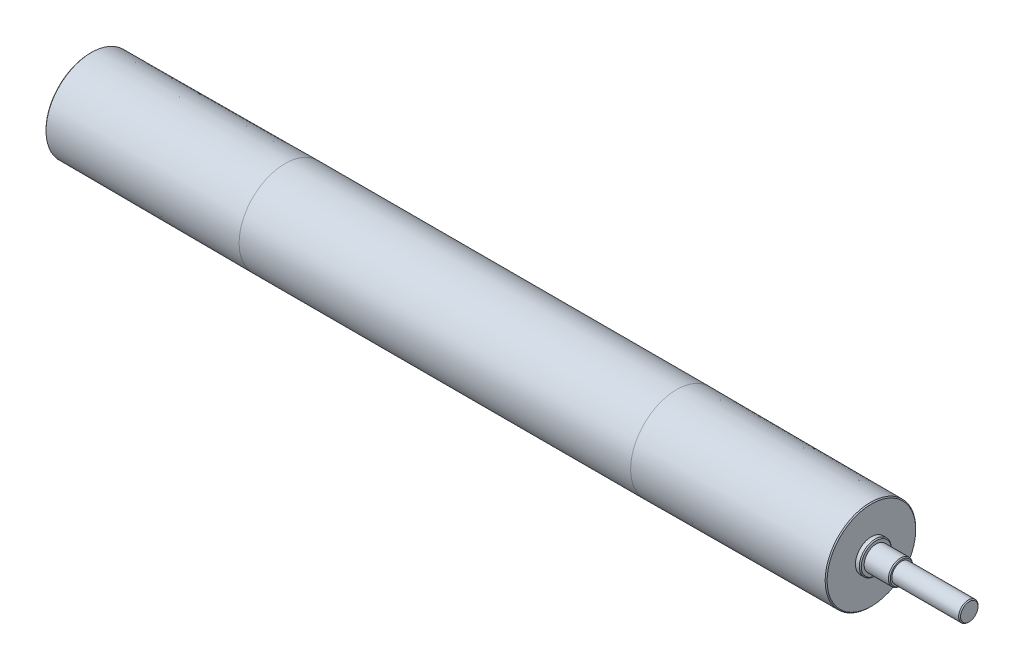
ISO-10303-21;
HEADER;
FILE_DESCRIPTION(('STEP AP214'),'2;1');
FILE_NAME('part.step','',(''),(''),'','','');
FILE_SCHEMA(('AUTOMOTIVE_DESIGN { 1 0 10303 214 1 1 1 1 }'));
ENDSEC;
DATA;
#1=APPLICATION_CONTEXT('core data for automotive mechanical design processes');
#2=APPLICATION_PROTOCOL_DEFINITION('international standard','automotive_design',2000,#1);
#3=PRODUCT_CONTEXT('',#1,'mechanical');
#4=PRODUCT('Part','Part','',(#3));
#5=PRODUCT_RELATED_PRODUCT_CATEGORY('part','',(#4));
#6=PRODUCT_DEFINITION_FORMATION('','',#4);
#7=PRODUCT_DEFINITION_CONTEXT('part definition',#1,'design');
#8=PRODUCT_DEFINITION('design','',#6,#7);
#9=PRODUCT_DEFINITION_SHAPE('','',#8);
#10=(LENGTH_UNIT() NAMED_UNIT(*) SI_UNIT(.MILLI.,.METRE.));
#11=(NAMED_UNIT(*) PLANE_ANGLE_UNIT() SI_UNIT($,.RADIAN.));
#12=(NAMED_UNIT(*) SI_UNIT($,.STERADIAN.) SOLID_ANGLE_UNIT());
#13=UNCERTAINTY_MEASURE_WITH_UNIT(LENGTH_MEASURE(1.E-05),#10,'distance_accuracy_value','');
#14=(GEOMETRIC_REPRESENTATION_CONTEXT(3) GLOBAL_UNCERTAINTY_ASSIGNED_CONTEXT((#13)) GLOBAL_UNIT_ASSIGNED_CONTEXT((#10,
#11,#12)) REPRESENTATION_CONTEXT('',''));
#15=CARTESIAN_POINT('',(0.,0.,0.));
#16=DIRECTION('',(0.,0.,1.));
#17=DIRECTION('',(1.,0.,0.));
#18=AXIS2_PLACEMENT_3D('',#15,#16,#17);
#19=CARTESIAN_POINT('',(-401.999999982421,0.,0.));
#20=DIRECTION('',(1.,0.,0.));
#21=DIRECTION('',(0.,0.,-1.));
#22=AXIS2_PLACEMENT_3D('',#19,#20,#21);
#23=CONICAL_SURFACE('',#22,46.75,0.00374998242202332);
#24=CARTESIAN_POINT('',(-201.999999982421,0.,0.));
#25=DIRECTION('',(-1.,0.,0.));
#26=DIRECTION('',(0.,0.,1.));
#27=AXIS2_PLACEMENT_3D('',#24,#25,#26);
#28=CIRCLE('',#27,47.5);
#29=CARTESIAN_POINT('',(-201.999999982421,0.,47.5));
#30=VERTEX_POINT('',#29);
#31=EDGE_CURVE('E97',#30,#30,#28,.T.);
#32=ORIENTED_EDGE('',*,*,#31,.T.);
#33=EDGE_LOOP('',(#32));
#34=FACE_BOUND('',#33,.T.);
#35=CARTESIAN_POINT('',(-401.999999982421,0.,0.));
#36=DIRECTION('',(-1.,0.,0.));
#37=DIRECTION('',(0.,0.,1.));
#38=AXIS2_PLACEMENT_3D('',#35,#36,#37);
#39=CIRCLE('',#38,46.75);
#40=CARTESIAN_POINT('',(-401.999999982421,0.,46.75));
#41=VERTEX_POINT('',#40);
#42=EDGE_CURVE('E160',#41,#41,#39,.T.);
#43=ORIENTED_EDGE('',*,*,#42,.F.);
#44=EDGE_LOOP('',(#43));
#45=FACE_BOUND('',#44,.T.);
#46=ADVANCED_FACE('F31',(#34,#45),#23,.T.);
#47=CARTESIAN_POINT('',(-402.999999982421,0.,0.));
#48=DIRECTION('',(1.,0.,0.));
#49=DIRECTION('',(0.,0.,-1.));
#50=AXIS2_PLACEMENT_3D('',#47,#48,#49);
#51=CONICAL_SURFACE('',#50,45.75,0.785398163397448);
#52=ORIENTED_EDGE('',*,*,#42,.T.);
#53=EDGE_LOOP('',(#52));
#54=FACE_BOUND('',#53,.T.);
#55=CARTESIAN_POINT('',(-402.999999982421,0.,0.));
#56=DIRECTION('',(-1.,0.,0.));
#57=DIRECTION('',(0.,0.,1.));
#58=AXIS2_PLACEMENT_3D('',#55,#56,#57);
#59=CIRCLE('',#58,45.75);
#60=CARTESIAN_POINT('',(-402.999999982421,0.,45.75));
#61=VERTEX_POINT('',#60);
#62=EDGE_CURVE('E157',#61,#61,#59,.T.);
#63=ORIENTED_EDGE('',*,*,#62,.F.);
#64=EDGE_LOOP('',(#63));
#65=FACE_BOUND('',#64,.T.);
#66=ADVANCED_FACE('F228',(#54,#65),#51,.T.);
#67=CARTESIAN_POINT('',(-402.999999982421,-45.75,0.));
#68=DIRECTION('',(-1.,0.,0.));
#69=DIRECTION('',(0.,0.,1.));
#70=AXIS2_PLACEMENT_3D('',#67,#68,#69);
#71=PLANE('',#70);
#72=ORIENTED_EDGE('',*,*,#62,.T.);
#73=EDGE_LOOP('',(#72));
#74=FACE_BOUND('',#73,.T.);
#75=CARTESIAN_POINT('',(-402.999999982421,0.,0.));
#76=DIRECTION('',(-1.,0.,0.));
#77=DIRECTION('',(0.,0.,1.));
#78=AXIS2_PLACEMENT_3D('',#75,#76,#77);
#79=CIRCLE('',#78,16.5);
#80=CARTESIAN_POINT('',(-402.999999982421,0.,16.5));
#81=VERTEX_POINT('',#80);
#82=EDGE_CURVE('E154',#81,#81,#79,.T.);
#83=ORIENTED_EDGE('',*,*,#82,.F.);
#84=EDGE_LOOP('',(#83));
#85=FACE_BOUND('',#84,.T.);
#86=ADVANCED_FACE('F233',(#74,#85),#71,.T.);
#87=CARTESIAN_POINT('',(-425.999999982421,0.,0.));
#88=DIRECTION('',(-1.,0.,0.));
#89=DIRECTION('',(0.,0.,1.));
#90=AXIS2_PLACEMENT_3D('',#87,#88,#89);
#91=CYLINDRICAL_SURFACE('',#90,16.5);
#92=ORIENTED_EDGE('',*,*,#82,.T.);
#93=EDGE_LOOP('',(#92));
#94=FACE_BOUND('',#93,.T.);
#95=CARTESIAN_POINT('',(-406.999999982421,0.,0.));
#96=DIRECTION('',(-1.,0.,0.));
#97=DIRECTION('',(0.,0.,1.));
#98=AXIS2_PLACEMENT_3D('',#95,#96,#97);
#99=CIRCLE('',#98,16.5);
#100=CARTESIAN_POINT('',(-406.999999982421,0.,16.5));
#101=VERTEX_POINT('',#100);
#102=EDGE_CURVE('E151',#101,#101,#99,.T.);
#103=ORIENTED_EDGE('',*,*,#102,.F.);
#104=EDGE_LOOP('',(#103));
#105=FACE_BOUND('',#104,.T.);
#106=ADVANCED_FACE('F243',(#94,#105),#91,.T.);
#107=CARTESIAN_POINT('',(-407.999999982421,0.,0.));
#108=DIRECTION('',(1.,0.,0.));
#109=DIRECTION('',(0.,0.,-1.));
#110=AXIS2_PLACEMENT_3D('',#107,#108,#109);
#111=CONICAL_SURFACE('',#110,15.5,0.78539816339745);
#112=ORIENTED_EDGE('',*,*,#102,.T.);
#113=EDGE_LOOP('',(#112));
#114=FACE_BOUND('',#113,.T.);
#115=CARTESIAN_POINT('',(-407.999999982421,0.,0.));
#116=DIRECTION('',(-1.,0.,0.));
#117=DIRECTION('',(0.,0.,1.));
#118=AXIS2_PLACEMENT_3D('',#115,#116,#117);
#119=CIRCLE('',#118,15.5);
#120=CARTESIAN_POINT('',(-407.999999982421,0.,15.5));
#121=VERTEX_POINT('',#120);
#122=EDGE_CURVE('E148',#121,#121,#119,.T.);
#123=ORIENTED_EDGE('',*,*,#122,.F.);
#124=EDGE_LOOP('',(#123));
#125=FACE_BOUND('',#124,.T.);
#126=ADVANCED_FACE('F249',(#114,#125),#111,.T.);
#127=CARTESIAN_POINT('',(-407.999999982421,-15.5,0.));
#128=DIRECTION('',(-1.,0.,0.));
#129=DIRECTION('',(0.,0.,1.));
#130=AXIS2_PLACEMENT_3D('',#127,#128,#129);
#131=PLANE('',#130);
#132=ORIENTED_EDGE('',*,*,#122,.T.);
#133=EDGE_LOOP('',(#132));
#134=FACE_BOUND('',#133,.T.);
#135=CARTESIAN_POINT('',(-407.999999982421,0.,0.));
#136=DIRECTION('',(-1.,0.,0.));
#137=DIRECTION('',(0.,0.,1.));
#138=AXIS2_PLACEMENT_3D('',#135,#136,#137);
#139=CIRCLE('',#138,12.5);
#140=CARTESIAN_POINT('',(-407.999999982421,0.,12.5));
#141=VERTEX_POINT('',#140);
#142=EDGE_CURVE('E145',#141,#141,#139,.T.);
#143=ORIENTED_EDGE('',*,*,#142,.F.);
#144=EDGE_LOOP('',(#143));
#145=FACE_BOUND('',#144,.T.);
#146=ADVANCED_FACE('F255',(#134,#145),#131,.T.);
#147=CARTESIAN_POINT('',(-425.999999982421,0.,0.));
#148=DIRECTION('',(-1.,0.,0.));
#149=DIRECTION('',(0.,0.,1.));
#150=AXIS2_PLACEMENT_3D('',#147,#148,#149);
#151=CYLINDRICAL_SURFACE('',#150,12.5);
#152=ORIENTED_EDGE('',*,*,#142,.T.);
#153=EDGE_LOOP('',(#152));
#154=FACE_BOUND('',#153,.T.);
#155=CARTESIAN_POINT('',(-424.999999982421,0.,0.));
#156=DIRECTION('',(-1.,0.,0.));
#157=DIRECTION('',(0.,0.,1.));
#158=AXIS2_PLACEMENT_3D('',#155,#156,#157);
#159=CIRCLE('',#158,12.5);
#160=CARTESIAN_POINT('',(-424.999999982421,0.,12.5));
#161=VERTEX_POINT('',#160);
#162=EDGE_CURVE('E142',#161,#161,#159,.T.);
#163=ORIENTED_EDGE('',*,*,#162,.F.);
#164=EDGE_LOOP('',(#163));
#165=FACE_BOUND('',#164,.T.);
#166=ADVANCED_FACE('F261',(#154,#165),#151,.T.);
#167=CARTESIAN_POINT('',(-425.999999982421,0.,0.));
#168=DIRECTION('',(1.,0.,0.));
#169=DIRECTION('',(0.,0.,-1.));
#170=AXIS2_PLACEMENT_3D('',#167,#168,#169);
#171=CONICAL_SURFACE('',#170,11.5,0.78539816339745);
#172=ORIENTED_EDGE('',*,*,#162,.T.);
#173=EDGE_LOOP('',(#172));
#174=FACE_BOUND('',#173,.T.);
#175=CARTESIAN_POINT('',(-425.999999982421,0.,0.));
#176=DIRECTION('',(-1.,0.,0.));
#177=DIRECTION('',(0.,0.,1.));
#178=AXIS2_PLACEMENT_3D('',#175,#176,#177);
#179=CIRCLE('',#178,11.5);
#180=CARTESIAN_POINT('',(-425.999999982421,0.,11.5));
#181=VERTEX_POINT('',#180);
#182=EDGE_CURVE('E139',#181,#181,#179,.T.);
#183=ORIENTED_EDGE('',*,*,#182,.F.);
#184=EDGE_LOOP('',(#183));
#185=FACE_BOUND('',#184,.T.);
#186=ADVANCED_FACE('F267',(#174,#185),#171,.T.);
#187=CARTESIAN_POINT('',(-425.999999982421,-11.5,0.));
#188=DIRECTION('',(-1.,0.,0.));
#189=DIRECTION('',(0.,0.,1.));
#190=AXIS2_PLACEMENT_3D('',#187,#188,#189);
#191=PLANE('',#190);
#192=ORIENTED_EDGE('',*,*,#182,.T.);
#193=EDGE_LOOP('',(#192));
#194=FACE_BOUND('',#193,.T.);
#195=ADVANCED_FACE('F273',(#194),#191,.T.);
#196=CARTESIAN_POINT('',(503.999999982421,-8.99999999999999,0.));
#197=DIRECTION('',(1.,0.,0.));
#198=DIRECTION('',(0.,0.,-1.));
#199=AXIS2_PLACEMENT_3D('',#196,#197,#198);
#200=PLANE('',#199);
#201=CARTESIAN_POINT('',(503.999999982421,0.,0.));
#202=DIRECTION('',(-1.,0.,0.));
#203=DIRECTION('',(0.,0.,1.));
#204=AXIS2_PLACEMENT_3D('',#201,#202,#203);
#205=CIRCLE('',#204,8.99999999999999);
#206=CARTESIAN_POINT('',(503.999999982421,0.,8.99999999999999));
#207=VERTEX_POINT('',#206);
#208=EDGE_CURVE('E136',#207,#207,#205,.T.);
#209=ORIENTED_EDGE('',*,*,#208,.F.);
#210=EDGE_LOOP('',(#209));
#211=FACE_BOUND('',#210,.T.);
#212=ADVANCED_FACE('F278',(#211),#200,.T.);
#213=CARTESIAN_POINT('',(502.999999982421,0.,0.));
#214=DIRECTION('',(-1.,0.,0.));
#215=DIRECTION('',(0.,0.,1.));
#216=AXIS2_PLACEMENT_3D('',#213,#214,#215);
#217=CONICAL_SURFACE('',#216,10.,0.785398163397507);
#218=ORIENTED_EDGE('',*,*,#208,.T.);
#219=EDGE_LOOP('',(#218));
#220=FACE_BOUND('',#219,.T.);
#221=CARTESIAN_POINT('',(502.999999982421,0.,0.));
#222=DIRECTION('',(-1.,0.,0.));
#223=DIRECTION('',(0.,0.,1.));
#224=AXIS2_PLACEMENT_3D('',#221,#222,#223);
#225=CIRCLE('',#224,10.);
#226=CARTESIAN_POINT('',(502.999999982421,0.,10.));
#227=VERTEX_POINT('',#226);
#228=EDGE_CURVE('E133',#227,#227,#225,.T.);
#229=ORIENTED_EDGE('',*,*,#228,.F.);
#230=EDGE_LOOP('',(#229));
#231=FACE_BOUND('',#230,.T.);
#232=ADVANCED_FACE('F225',(#220,#231),#217,.T.);
#233=CARTESIAN_POINT('',(-425.999999982421,0.,0.));
#234=DIRECTION('',(-1.,0.,0.));
#235=DIRECTION('',(0.,0.,1.));
#236=AXIS2_PLACEMENT_3D('',#233,#234,#235);
#237=CYLINDRICAL_SURFACE('',#236,10.);
#238=CARTESIAN_POINT('',(495.999999982421,3.,-9.53939201416945));
#239=CARTESIAN_POINT('',(496.082335503244,3.00001027845728,-9.53938054248206));
#240=CARTESIAN_POINT('',(496.164664437484,2.99661062684472,-9.54045772064378));
#241=CARTESIAN_POINT('',(496.328693935187,2.98307142899347,-9.54470412105986));
#242=CARTESIAN_POINT('',(496.410394635745,2.97293339805419,-9.54787287296848));
#243=CARTESIAN_POINT('',(496.572384898094,2.94603140625046,-9.55620668351003));
#244=CARTESIAN_POINT('',(496.652677506464,2.92928426957738,-9.56136667250114));
#245=CARTESIAN_POINT('',(496.811475826555,2.88932853030396,-9.57351626651178));
#246=CARTESIAN_POINT('',(496.889981491489,2.86611975872642,-9.58050591937827));
#247=CARTESIAN_POINT('',(497.121949370411,2.78708584446026,-9.60391637654136));
#248=CARTESIAN_POINT('',(497.272068421254,2.72181852542974,-9.6227900783039));
#249=CARTESIAN_POINT('',(497.5592260264,2.56815043531278,-9.66493213967818));
#250=CARTESIAN_POINT('',(497.696258453183,2.47973889924162,-9.6882025429064));
#251=CARTESIAN_POINT('',(497.957722970369,2.27929879634445,-9.73733650515374));
#252=CARTESIAN_POINT('',(498.081684856482,2.16666914746587,-9.76325505469873));
#253=CARTESIAN_POINT('',(498.30927359726,1.92227736150436,-9.81429628475076));
#254=CARTESIAN_POINT('',(498.412897016282,1.79051199848167,-9.83941883019409));
#255=CARTESIAN_POINT('',(498.598926847516,1.508219974657,-9.88666477976534));
#256=CARTESIAN_POINT('',(498.680850162204,1.35736167401017,-9.90871541546877));
#257=CARTESIAN_POINT('',(498.817976986424,1.04324233568303,-9.94668940088144));
#258=CARTESIAN_POINT('',(498.873187385789,0.879984508687995,-9.96261433032402));
#259=CARTESIAN_POINT('',(498.953759534212,0.550649404820613,-9.98615279768397));
#260=CARTESIAN_POINT('',(498.979929685939,0.384786253016212,-9.99399098526792));
#261=CARTESIAN_POINT('',(499.004234677567,0.0508471415689337,-10.0012640407204));
#262=CARTESIAN_POINT('',(499.002374825099,-0.117228393125334,-10.0007004995012));
#263=CARTESIAN_POINT('',(498.97121416173,-0.44514319927182,-9.99139205125586));
#264=CARTESIAN_POINT('',(498.942789291613,-0.605074290763024,-9.98290831016512));
#265=CARTESIAN_POINT('',(498.860736712796,-0.917780104370305,-9.95903027401822));
#266=CARTESIAN_POINT('',(498.807107683738,-1.07055445110878,-9.94363561692558));
#267=CARTESIAN_POINT('',(498.675575538896,-1.36669563173911,-9.90730429851782));
#268=CARTESIAN_POINT('',(498.597396693645,-1.50993201207613,-9.88630511384915));
#269=CARTESIAN_POINT('',(498.419202802387,-1.78153105916101,-9.84099249303646));
#270=CARTESIAN_POINT('',(498.31918286348,-1.90989038323251,-9.81667831471806));
#271=CARTESIAN_POINT('',(498.095616006237,-2.15330901082204,-9.7662334714278));
#272=CARTESIAN_POINT('',(497.971312254895,-2.26766702955974,-9.74006890899097));
#273=CARTESIAN_POINT('',(497.70500513557,-2.47413538985066,-9.68968430229327));
#274=CARTESIAN_POINT('',(497.562996621691,-2.5662392402618,-9.66546482675133));
#275=CARTESIAN_POINT('',(497.263438125521,-2.72632814481702,-9.62154457591303));
#276=CARTESIAN_POINT('',(497.105745623234,-2.79406012682262,-9.60189192491895));
#277=CARTESIAN_POINT('',(496.780550974458,-2.90171772009403,-9.56991327306403));
#278=CARTESIAN_POINT('',(496.613064260992,-2.94168586436071,-9.5575760695175));
#279=CARTESIAN_POINT('',(496.370010204281,-2.97802407180158,-9.54628064650012));
#280=CARTESIAN_POINT('',(496.296218514062,-2.98626405978017,-9.54370312550533));
#281=CARTESIAN_POINT('',(496.148297024222,-2.99724711229708,-9.54025857223564));
#282=CARTESIAN_POINT('',(496.074167883093,-2.99999825936538,-9.53938902493288));
#283=CARTESIAN_POINT('',(495.999999982421,-3.,-9.53939201416945));
#284=B_SPLINE_CURVE_WITH_KNOTS('',3,(#238,#239,#240,#241,#242,#243,#244,#245,#246,#247,#248,
#249,#250,#251,#252,#253,#254,#255,#256,#257,#258,#259,#260,#261,#262,#263,#264,#265,#266,#267,
#268,#269,#270,#271,#272,#273,#274,#275,#276,#277,#278,#279,#280,#281,#282,#283),.UNSPECIFIED.,
.F.,.F.,(4,2,2,2,2,2,2,2,2,2,2,2,2,2,2,2,2,2,2,2,2,2,4),(0.,0.246918142439419,0.493780777706024,
0.740019009622899,0.986263681482011,1.47813347402017,1.97023245590772,2.47635119822762,
2.9825553623903,3.49922810620069,4.01576751791671,4.51753600864763,5.019209488041,
5.50490358251093,5.99062312360831,6.4820058335062,6.9734987373917,7.48389234847121,
7.99443465298712,8.51013494368211,9.02504345105571,9.24774267716771,9.4701137273239),.UNSPECIFIED.);
#285=CARTESIAN_POINT('',(495.999999982421,3.,-9.53939201416945));
#286=VERTEX_POINT('',#285);
#287=CARTESIAN_POINT('',(495.999999982421,-3.,-9.53939201416945));
#288=VERTEX_POINT('',#287);
#289=EDGE_CURVE('E163',#286,#288,#284,.T.);
#290=ORIENTED_EDGE('',*,*,#289,.F.);
#291=DIRECTION('',(-1.,0.,0.));
#292=VECTOR('',#291,1.);
#293=CARTESIAN_POINT('',(-425.999999982421,3.,-9.53939201416945));
#294=LINE('',#293,#292);
#295=CARTESIAN_POINT('',(451.999999982421,3.,-9.53939201416945));
#296=VERTEX_POINT('',#295);
#297=EDGE_CURVE('E11',#296,#286,#294,.F.);
#298=ORIENTED_EDGE('',*,*,#297,.F.);
#299=CARTESIAN_POINT('',(451.999999982421,-3.,-9.53939201416945));
#300=CARTESIAN_POINT('',(451.917664461599,-3.00001027845728,-9.53938054248206));
#301=CARTESIAN_POINT('',(451.835335527358,-2.99661062684473,-9.54045772064378));
#302=CARTESIAN_POINT('',(451.671306029656,-2.98307142899348,-9.54470412105985));
#303=CARTESIAN_POINT('',(451.589605329097,-2.9729333980542,-9.54787287296848));
#304=CARTESIAN_POINT('',(451.427615066748,-2.94603140625047,-9.55620668351002));
#305=CARTESIAN_POINT('',(451.347322458378,-2.92928426957739,-9.56136667250114));
#306=CARTESIAN_POINT('',(451.188524138287,-2.88932853030397,-9.57351626651177));
#307=CARTESIAN_POINT('',(451.110018473354,-2.86611975872643,-9.58050591937827));
#308=CARTESIAN_POINT('',(450.878050594431,-2.78708584446027,-9.60391637654136));
#309=CARTESIAN_POINT('',(450.727931543588,-2.72181852542975,-9.6227900783039));
#310=CARTESIAN_POINT('',(450.440773938442,-2.56815043531278,-9.66493213967818));
#311=CARTESIAN_POINT('',(450.303741511659,-2.47973889924163,-9.6882025429064));
#312=CARTESIAN_POINT('',(450.042276994473,-2.27929879634446,-9.73733650515373));
#313=CARTESIAN_POINT('',(449.91831510836,-2.16666914746589,-9.76325505469872));
#314=CARTESIAN_POINT('',(449.690726367582,-1.92227736150438,-9.81429628475076));
#315=CARTESIAN_POINT('',(449.58710294856,-1.79051199848168,-9.83941883019409));
#316=CARTESIAN_POINT('',(449.401073117327,-1.50821997465701,-9.88666477976534));
#317=CARTESIAN_POINT('',(449.319149802639,-1.3573616740102,-9.90871541546877));
#318=CARTESIAN_POINT('',(449.182022978418,-1.04324233568308,-9.94668940088143));
#319=CARTESIAN_POINT('',(449.126812579053,-0.879984508688037,-9.96261433032402));
#320=CARTESIAN_POINT('',(449.04624043063,-0.550649404820658,-9.98615279768397));
#321=CARTESIAN_POINT('',(449.020070278904,-0.384786253016264,-9.99399098526792));
#322=CARTESIAN_POINT('',(448.995765287275,-0.0508471415689935,-10.0012640407204));
#323=CARTESIAN_POINT('',(448.997625139743,0.117228393125273,-10.0007004995012));
#324=CARTESIAN_POINT('',(449.028785803113,0.445143199271763,-9.99139205125586));
#325=CARTESIAN_POINT('',(449.057210673229,0.605074290762971,-9.98290831016512));
#326=CARTESIAN_POINT('',(449.139263252047,0.917780104370259,-9.95903027401823));
#327=CARTESIAN_POINT('',(449.192892281104,1.07055445110873,-9.94363561692559));
#328=CARTESIAN_POINT('',(449.324424425946,1.36669563173906,-9.90730429851782));
#329=CARTESIAN_POINT('',(449.402603271197,1.50993201207607,-9.88630511384915));
#330=CARTESIAN_POINT('',(449.580797162456,1.78153105916094,-9.84099249303648));
#331=CARTESIAN_POINT('',(449.680817101362,1.90989038323244,-9.81667831471807));
#332=CARTESIAN_POINT('',(449.904383958606,2.15330901082201,-9.76623347142781));
#333=CARTESIAN_POINT('',(450.028687709947,2.26766702955972,-9.74006890899098));
#334=CARTESIAN_POINT('',(450.294994829272,2.47413538985064,-9.68968430229328));
#335=CARTESIAN_POINT('',(450.437003343151,2.56623924026177,-9.66546482675134));
#336=CARTESIAN_POINT('',(450.736561839321,2.72632814481699,-9.62154457591303));
#337=CARTESIAN_POINT('',(450.894254341608,2.79406012682261,-9.60189192491896));
#338=CARTESIAN_POINT('',(451.219448990384,2.90171772009404,-9.56991327306402));
#339=CARTESIAN_POINT('',(451.38693570385,2.94168586436071,-9.5575760695175));
#340=CARTESIAN_POINT('',(451.629989760562,2.97802407180158,-9.54628064650012));
#341=CARTESIAN_POINT('',(451.70378145078,2.98626405978017,-9.54370312550533));
#342=CARTESIAN_POINT('',(451.85170294062,2.99724711229709,-9.54025857223564));
#343=CARTESIAN_POINT('',(451.925832081749,2.99999825936538,-9.53938902493287));
#344=CARTESIAN_POINT('',(451.999999982421,3.,-9.53939201416945));
#345=B_SPLINE_CURVE_WITH_KNOTS('',3,(#299,#300,#301,#302,#303,#304,#305,#306,#307,#308,#309,
#310,#311,#312,#313,#314,#315,#316,#317,#318,#319,#320,#321,#322,#323,#324,#325,#326,#327,#328,
#329,#330,#331,#332,#333,#334,#335,#336,#337,#338,#339,#340,#341,#342,#343,#344),.UNSPECIFIED.,
.F.,.F.,(4,2,2,2,2,2,2,2,2,2,2,2,2,2,2,2,2,2,2,2,2,2,4),(0.,0.246918142439418,0.493780777706023,
0.740019009622954,0.986263681482008,1.47813347402023,1.97023245590777,2.47635119822762,
2.98255536239031,3.4992281062007,4.01576751791671,4.51753600864762,5.019209488041,
5.50490358251091,5.9906231236083,6.48200583350621,6.97349873739168,7.48389234847121,
7.99443465298716,8.51013494368217,9.02504345105577,9.24774267716782,9.47011372732401),.UNSPECIFIED.);
#346=CARTESIAN_POINT('',(451.999999982421,-3.,-9.53939201416945));
#347=VERTEX_POINT('',#346);
#348=EDGE_CURVE('E38',#347,#296,#345,.T.);
#349=ORIENTED_EDGE('',*,*,#348,.F.);
#350=DIRECTION('',(-1.,0.,0.));
#351=VECTOR('',#350,1.);
#352=CARTESIAN_POINT('',(-425.999999982421,-3.,-9.53939201416945));
#353=LINE('',#352,#351);
#354=EDGE_CURVE('E170',#347,#288,#353,.F.);
#355=ORIENTED_EDGE('',*,*,#354,.T.);
#356=EDGE_LOOP('',(#290,#298,#349,#355));
#357=FACE_BOUND('',#356,.T.);
#358=ORIENTED_EDGE('',*,*,#228,.T.);
#359=EDGE_LOOP('',(#358));
#360=FACE_BOUND('',#359,.T.);
#361=CARTESIAN_POINT('',(433.999999982421,0.,0.));
#362=DIRECTION('',(-1.,0.,0.));
#363=DIRECTION('',(0.,0.,1.));
#364=AXIS2_PLACEMENT_3D('',#361,#362,#363);
#365=CIRCLE('',#364,10.);
#366=CARTESIAN_POINT('',(433.999999982421,0.,10.));
#367=VERTEX_POINT('',#366);
#368=EDGE_CURVE('E130',#367,#367,#365,.T.);
#369=ORIENTED_EDGE('',*,*,#368,.F.);
#370=EDGE_LOOP('',(#369));
#371=FACE_BOUND('',#370,.T.);
#372=ADVANCED_FACE('F171',(#357,#360,#371),#237,.T.);
#373=CARTESIAN_POINT('',(433.999999982421,-11.5,0.));
#374=DIRECTION('',(1.,0.,0.));
#375=DIRECTION('',(0.,0.,-1.));
#376=AXIS2_PLACEMENT_3D('',#373,#374,#375);
#377=PLANE('',#376);
#378=ORIENTED_EDGE('',*,*,#368,.T.);
#379=EDGE_LOOP('',(#378));
#380=FACE_BOUND('',#379,.T.);
#381=CARTESIAN_POINT('',(433.999999982421,0.,0.));
#382=DIRECTION('',(-1.,0.,0.));
#383=DIRECTION('',(0.,0.,1.));
#384=AXIS2_PLACEMENT_3D('',#381,#382,#383);
#385=CIRCLE('',#384,11.5);
#386=CARTESIAN_POINT('',(433.999999982421,0.,11.5));
#387=VERTEX_POINT('',#386);
#388=EDGE_CURVE('E127',#387,#387,#385,.T.);
#389=ORIENTED_EDGE('',*,*,#388,.F.);
#390=EDGE_LOOP('',(#389));
#391=FACE_BOUND('',#390,.T.);
#392=ADVANCED_FACE('F218',(#380,#391),#377,.T.);
#393=CARTESIAN_POINT('',(432.999999982421,0.,0.));
#394=DIRECTION('',(-1.,0.,0.));
#395=DIRECTION('',(0.,0.,1.));
#396=AXIS2_PLACEMENT_3D('',#393,#394,#395);
#397=CONICAL_SURFACE('',#396,12.5,0.78539816339745);
#398=ORIENTED_EDGE('',*,*,#388,.T.);
#399=EDGE_LOOP('',(#398));
#400=FACE_BOUND('',#399,.T.);
#401=CARTESIAN_POINT('',(432.999999982421,0.,0.));
#402=DIRECTION('',(-1.,0.,0.));
#403=DIRECTION('',(0.,0.,1.));
#404=AXIS2_PLACEMENT_3D('',#401,#402,#403);
#405=CIRCLE('',#404,12.5);
#406=CARTESIAN_POINT('',(432.999999982421,0.,12.5));
#407=VERTEX_POINT('',#406);
#408=EDGE_CURVE('E124',#407,#407,#405,.T.);
#409=ORIENTED_EDGE('',*,*,#408,.F.);
#410=EDGE_LOOP('',(#409));
#411=FACE_BOUND('',#410,.T.);
#412=ADVANCED_FACE('F215',(#400,#411),#397,.T.);
#413=CARTESIAN_POINT('',(-425.999999982421,0.,0.));
#414=DIRECTION('',(-1.,0.,0.));
#415=DIRECTION('',(0.,0.,1.));
#416=AXIS2_PLACEMENT_3D('',#413,#414,#415);
#417=CYLINDRICAL_SURFACE('',#416,12.5);
#418=ORIENTED_EDGE('',*,*,#408,.T.);
#419=EDGE_LOOP('',(#418));
#420=FACE_BOUND('',#419,.T.);
#421=CARTESIAN_POINT('',(407.999999982421,0.,0.));
#422=DIRECTION('',(-1.,0.,0.));
#423=DIRECTION('',(0.,0.,1.));
#424=AXIS2_PLACEMENT_3D('',#421,#422,#423);
#425=CIRCLE('',#424,12.5);
#426=CARTESIAN_POINT('',(407.999999982421,0.,12.5));
#427=VERTEX_POINT('',#426);
#428=EDGE_CURVE('E121',#427,#427,#425,.T.);
#429=ORIENTED_EDGE('',*,*,#428,.F.);
#430=EDGE_LOOP('',(#429));
#431=FACE_BOUND('',#430,.T.);
#432=ADVANCED_FACE('F211',(#420,#431),#417,.T.);
#433=CARTESIAN_POINT('',(407.999999982421,-15.5,0.));
#434=DIRECTION('',(1.,0.,0.));
#435=DIRECTION('',(0.,0.,-1.));
#436=AXIS2_PLACEMENT_3D('',#433,#434,#435);
#437=PLANE('',#436);
#438=ORIENTED_EDGE('',*,*,#428,.T.);
#439=EDGE_LOOP('',(#438));
#440=FACE_BOUND('',#439,.T.);
#441=CARTESIAN_POINT('',(407.999999982421,0.,0.));
#442=DIRECTION('',(-1.,0.,0.));
#443=DIRECTION('',(0.,0.,1.));
#444=AXIS2_PLACEMENT_3D('',#441,#442,#443);
#445=CIRCLE('',#444,15.5);
#446=CARTESIAN_POINT('',(407.999999982421,0.,15.5));
#447=VERTEX_POINT('',#446);
#448=EDGE_CURVE('E118',#447,#447,#445,.T.);
#449=ORIENTED_EDGE('',*,*,#448,.F.);
#450=EDGE_LOOP('',(#449));
#451=FACE_BOUND('',#450,.T.);
#452=ADVANCED_FACE('F207',(#440,#451),#437,.T.);
#453=CARTESIAN_POINT('',(406.999999982421,0.,0.));
#454=DIRECTION('',(-1.,0.,0.));
#455=DIRECTION('',(0.,0.,1.));
#456=AXIS2_PLACEMENT_3D('',#453,#454,#455);
#457=CONICAL_SURFACE('',#456,16.5,0.78539816339745);
#458=ORIENTED_EDGE('',*,*,#448,.T.);
#459=EDGE_LOOP('',(#458));
#460=FACE_BOUND('',#459,.T.);
#461=CARTESIAN_POINT('',(406.999999982421,0.,0.));
#462=DIRECTION('',(-1.,0.,0.));
#463=DIRECTION('',(0.,0.,1.));
#464=AXIS2_PLACEMENT_3D('',#461,#462,#463);
#465=CIRCLE('',#464,16.5);
#466=CARTESIAN_POINT('',(406.999999982421,0.,16.5));
#467=VERTEX_POINT('',#466);
#468=EDGE_CURVE('E115',#467,#467,#465,.T.);
#469=ORIENTED_EDGE('',*,*,#468,.F.);
#470=EDGE_LOOP('',(#469));
#471=FACE_BOUND('',#470,.T.);
#472=ADVANCED_FACE('F203',(#460,#471),#457,.T.);
#473=CARTESIAN_POINT('',(-425.999999982421,0.,0.));
#474=DIRECTION('',(-1.,0.,0.));
#475=DIRECTION('',(0.,0.,1.));
#476=AXIS2_PLACEMENT_3D('',#473,#474,#475);
#477=CYLINDRICAL_SURFACE('',#476,16.5);
#478=ORIENTED_EDGE('',*,*,#468,.T.);
#479=EDGE_LOOP('',(#478));
#480=FACE_BOUND('',#479,.T.);
#481=CARTESIAN_POINT('',(402.999999982421,0.,0.));
#482=DIRECTION('',(-1.,0.,0.));
#483=DIRECTION('',(0.,0.,1.));
#484=AXIS2_PLACEMENT_3D('',#481,#482,#483);
#485=CIRCLE('',#484,16.5);
#486=CARTESIAN_POINT('',(402.999999982421,0.,16.5));
#487=VERTEX_POINT('',#486);
#488=EDGE_CURVE('E112',#487,#487,#485,.T.);
#489=ORIENTED_EDGE('',*,*,#488,.F.);
#490=EDGE_LOOP('',(#489));
#491=FACE_BOUND('',#490,.T.);
#492=ADVANCED_FACE('F199',(#480,#491),#477,.T.);
#493=CARTESIAN_POINT('',(402.999999982421,-45.7424717691342,0.));
#494=DIRECTION('',(1.,0.,0.));
#495=DIRECTION('',(0.,0.,-1.));
#496=AXIS2_PLACEMENT_3D('',#493,#494,#495);
#497=PLANE('',#496);
#498=ORIENTED_EDGE('',*,*,#488,.T.);
#499=EDGE_LOOP('',(#498));
#500=FACE_BOUND('',#499,.T.);
#501=CARTESIAN_POINT('',(402.999999982421,0.,0.));
#502=DIRECTION('',(-1.,0.,0.));
#503=DIRECTION('',(0.,0.,1.));
#504=AXIS2_PLACEMENT_3D('',#501,#502,#503);
#505=CIRCLE('',#504,45.7424717691342);
#506=CARTESIAN_POINT('',(402.999999982421,0.,45.7424717691342));
#507=VERTEX_POINT('',#506);
#508=EDGE_CURVE('E109',#507,#507,#505,.T.);
#509=ORIENTED_EDGE('',*,*,#508,.F.);
#510=EDGE_LOOP('',(#509));
#511=FACE_BOUND('',#510,.T.);
#512=ADVANCED_FACE('F195',(#500,#511),#497,.T.);
#513=CARTESIAN_POINT('',(401.999999982421,0.,0.));
#514=DIRECTION('',(-1.,0.,0.));
#515=DIRECTION('',(0.,0.,1.));
#516=AXIS2_PLACEMENT_3D('',#513,#514,#515);
#517=CONICAL_SURFACE('',#516,46.75,0.789148145819473);
#518=ORIENTED_EDGE('',*,*,#508,.T.);
#519=EDGE_LOOP('',(#518));
#520=FACE_BOUND('',#519,.T.);
#521=CARTESIAN_POINT('',(401.999999982421,0.,0.));
#522=DIRECTION('',(-1.,0.,0.));
#523=DIRECTION('',(0.,0.,1.));
#524=AXIS2_PLACEMENT_3D('',#521,#522,#523);
#525=CIRCLE('',#524,46.75);
#526=CARTESIAN_POINT('',(401.999999982421,0.,46.75));
#527=VERTEX_POINT('',#526);
#528=EDGE_CURVE('E106',#527,#527,#525,.T.);
#529=ORIENTED_EDGE('',*,*,#528,.F.);
#530=EDGE_LOOP('',(#529));
#531=FACE_BOUND('',#530,.T.);
#532=ADVANCED_FACE('F191',(#520,#531),#517,.T.);
#533=CARTESIAN_POINT('',(201.999999982421,0.,0.));
#534=DIRECTION('',(-1.,0.,0.));
#535=DIRECTION('',(0.,0.,1.));
#536=AXIS2_PLACEMENT_3D('',#533,#534,#535);
#537=CONICAL_SURFACE('',#536,47.5,0.00374998242202332);
#538=ORIENTED_EDGE('',*,*,#528,.T.);
#539=EDGE_LOOP('',(#538));
#540=FACE_BOUND('',#539,.T.);
#541=CARTESIAN_POINT('',(201.999999982421,0.,0.));
#542=DIRECTION('',(-1.,0.,0.));
#543=DIRECTION('',(0.,0.,1.));
#544=AXIS2_PLACEMENT_3D('',#541,#542,#543);
#545=CIRCLE('',#544,47.5);
#546=CARTESIAN_POINT('',(201.999999982421,0.,47.5));
#547=VERTEX_POINT('',#546);
#548=EDGE_CURVE('E103',#547,#547,#545,.T.);
#549=ORIENTED_EDGE('',*,*,#548,.F.);
#550=EDGE_LOOP('',(#549));
#551=FACE_BOUND('',#550,.T.);
#552=ADVANCED_FACE('F187',(#540,#551),#537,.T.);
#553=CARTESIAN_POINT('',(-425.999999982421,0.,0.));
#554=DIRECTION('',(-1.,0.,0.));
#555=DIRECTION('',(0.,0.,1.));
#556=AXIS2_PLACEMENT_3D('',#553,#554,#555);
#557=CYLINDRICAL_SURFACE('',#556,47.5);
#558=ORIENTED_EDGE('',*,*,#548,.T.);
#559=EDGE_LOOP('',(#558));
#560=FACE_BOUND('',#559,.T.);
#561=ORIENTED_EDGE('',*,*,#31,.F.);
#562=EDGE_LOOP('',(#561));
#563=FACE_BOUND('',#562,.T.);
#564=ADVANCED_FACE('F184',(#560,#563),#557,.T.);
#565=CARTESIAN_POINT('',(431.068177868879,3.,-6.5));
#566=DIRECTION('',(0.,1.,0.));
#567=DIRECTION('',(0.,0.,1.));
#568=AXIS2_PLACEMENT_3D('',#565,#566,#567);
#569=PLANE('',#568);
#570=ORIENTED_EDGE('',*,*,#297,.T.);
#571=DIRECTION('',(0.,0.,-1.));
#572=VECTOR('',#571,1.);
#573=CARTESIAN_POINT('',(495.999999982421,3.,-6.5));
#574=LINE('',#573,#572);
#575=CARTESIAN_POINT('',(495.999999982421,3.,-6.5));
#576=VERTEX_POINT('',#575);
#577=EDGE_CURVE('E70',#576,#286,#574,.T.);
#578=ORIENTED_EDGE('',*,*,#577,.F.);
#579=DIRECTION('',(1.,0.,0.));
#580=VECTOR('',#579,1.);
#581=CARTESIAN_POINT('',(431.068177868879,3.,-6.5));
#582=LINE('',#581,#580);
#583=CARTESIAN_POINT('',(451.999999982421,3.,-6.5));
#584=VERTEX_POINT('',#583);
#585=EDGE_CURVE('E74',#584,#576,#582,.T.);
#586=ORIENTED_EDGE('',*,*,#585,.F.);
#587=DIRECTION('',(0.,0.,-1.));
#588=VECTOR('',#587,1.);
#589=CARTESIAN_POINT('',(451.999999982421,3.,-6.5));
#590=LINE('',#589,#588);
#591=EDGE_CURVE('E95',#584,#296,#590,.T.);
#592=ORIENTED_EDGE('',*,*,#591,.T.);
#593=EDGE_LOOP('',(#570,#578,#586,#592));
#594=FACE_BOUND('',#593,.T.);
#595=ADVANCED_FACE('F72',(#594),#569,.F.);
#596=CARTESIAN_POINT('',(451.999999982421,0.,-6.5));
#597=DIRECTION('',(0.,0.,-1.));
#598=DIRECTION('',(0.,1.,0.));
#599=AXIS2_PLACEMENT_3D('',#596,#597,#598);
#600=CYLINDRICAL_SURFACE('',#599,3.);
#601=DIRECTION('',(0.,0.,-1.));
#602=VECTOR('',#601,1.);
#603=CARTESIAN_POINT('',(451.999999982421,-3.,-6.5));
#604=LINE('',#603,#602);
#605=CARTESIAN_POINT('',(451.999999982421,-3.,-6.5));
#606=VERTEX_POINT('',#605);
#607=EDGE_CURVE('E98',#606,#347,#604,.T.);
#608=ORIENTED_EDGE('',*,*,#607,.T.);
#609=ORIENTED_EDGE('',*,*,#348,.T.);
#610=ORIENTED_EDGE('',*,*,#591,.F.);
#611=CARTESIAN_POINT('',(451.999999982421,0.,-6.5));
#612=DIRECTION('',(0.,0.,-1.));
#613=DIRECTION('',(0.,1.,0.));
#614=AXIS2_PLACEMENT_3D('',#611,#612,#613);
#615=CIRCLE('',#614,3.);
#616=EDGE_CURVE('E78',#606,#584,#615,.T.);
#617=ORIENTED_EDGE('',*,*,#616,.F.);
#618=EDGE_LOOP('',(#608,#609,#610,#617));
#619=FACE_BOUND('',#618,.T.);
#620=ADVANCED_FACE('F183',(#619),#600,.F.);
#621=CARTESIAN_POINT('',(431.068177868879,-3.,-6.5));
#622=DIRECTION('',(0.,1.,0.));
#623=DIRECTION('',(0.,0.,1.));
#624=AXIS2_PLACEMENT_3D('',#621,#622,#623);
#625=PLANE('',#624);
#626=ORIENTED_EDGE('',*,*,#607,.F.);
#627=DIRECTION('',(1.,0.,0.));
#628=VECTOR('',#627,1.);
#629=CARTESIAN_POINT('',(431.068177868879,-3.,-6.5));
#630=LINE('',#629,#628);
#631=CARTESIAN_POINT('',(495.999999982421,-3.,-6.5));
#632=VERTEX_POINT('',#631);
#633=EDGE_CURVE('E87',#606,#632,#630,.T.);
#634=ORIENTED_EDGE('',*,*,#633,.T.);
#635=DIRECTION('',(0.,0.,-1.));
#636=VECTOR('',#635,1.);
#637=CARTESIAN_POINT('',(495.999999982421,-3.,-6.5));
#638=LINE('',#637,#636);
#639=EDGE_CURVE('E77',#632,#288,#638,.T.);
#640=ORIENTED_EDGE('',*,*,#639,.T.);
#641=ORIENTED_EDGE('',*,*,#354,.F.);
#642=EDGE_LOOP('',(#626,#634,#640,#641));
#643=FACE_BOUND('',#642,.T.);
#644=ADVANCED_FACE('F179',(#643),#625,.T.);
#645=CARTESIAN_POINT('',(495.999999982421,0.,-6.5));
#646=DIRECTION('',(0.,0.,-1.));
#647=DIRECTION('',(0.,1.,0.));
#648=AXIS2_PLACEMENT_3D('',#645,#646,#647);
#649=CYLINDRICAL_SURFACE('',#648,3.);
#650=ORIENTED_EDGE('',*,*,#577,.T.);
#651=ORIENTED_EDGE('',*,*,#289,.T.);
#652=ORIENTED_EDGE('',*,*,#639,.F.);
#653=CARTESIAN_POINT('',(495.999999982421,0.,-6.5));
#654=DIRECTION('',(0.,0.,-1.));
#655=DIRECTION('',(0.,1.,0.));
#656=AXIS2_PLACEMENT_3D('',#653,#654,#655);
#657=CIRCLE('',#656,3.);
#658=EDGE_CURVE('E82',#576,#632,#657,.T.);
#659=ORIENTED_EDGE('',*,*,#658,.F.);
#660=EDGE_LOOP('',(#650,#651,#652,#659));
#661=FACE_BOUND('',#660,.T.);
#662=ADVANCED_FACE('F83',(#661),#649,.F.);
#663=CARTESIAN_POINT('',(431.068177868879,0.,-6.5));
#664=DIRECTION('',(0.,0.,-1.));
#665=DIRECTION('',(0.,1.,0.));
#666=AXIS2_PLACEMENT_3D('',#663,#664,#665);
#667=PLANE('',#666);
#668=ORIENTED_EDGE('',*,*,#585,.T.);
#669=ORIENTED_EDGE('',*,*,#658,.T.);
#670=ORIENTED_EDGE('',*,*,#633,.F.);
#671=ORIENTED_EDGE('',*,*,#616,.T.);
#672=EDGE_LOOP('',(#668,#669,#670,#671));
#673=FACE_BOUND('',#672,.T.);
#674=ADVANCED_FACE('F89',(#673),#667,.T.);
#675=CLOSED_SHELL('',(#46,#66,#86,#106,#126,#146,#166,#186,#195,#212,#232,#372,#392,#412,#432,
#452,#472,#492,#512,#532,#552,#564,#595,#620,#644,#662,#674));
#676=MANIFOLD_SOLID_BREP('B2',#675);
#677=ADVANCED_BREP_SHAPE_REPRESENTATION('',(#18,#676),#14);
#678=SHAPE_DEFINITION_REPRESENTATION(#9,#677);
ENDSEC;
END-ISO-10303-21;
